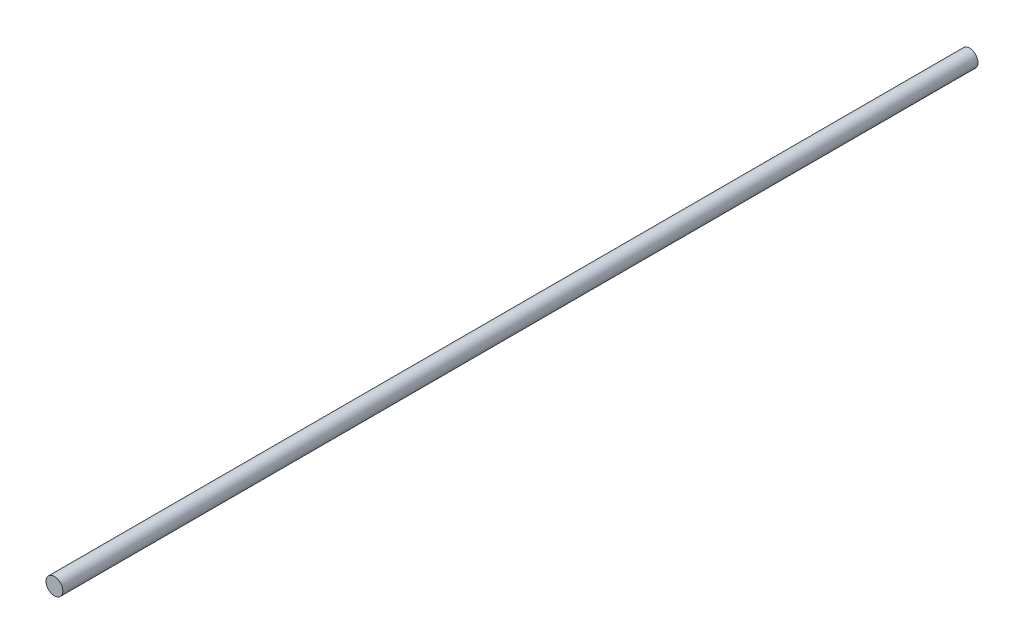
ISO-10303-21;
HEADER;
FILE_DESCRIPTION(('STEP AP214'),'2;1');
FILE_NAME('part.step','',(''),(''),'','','');
FILE_SCHEMA(('AUTOMOTIVE_DESIGN { 1 0 10303 214 1 1 1 1 }'));
ENDSEC;
DATA;
#1=APPLICATION_CONTEXT('core data for automotive mechanical design processes');
#2=APPLICATION_PROTOCOL_DEFINITION('international standard','automotive_design',2000,#1);
#3=PRODUCT_CONTEXT('',#1,'mechanical');
#4=PRODUCT('Part','Part','',(#3));
#5=PRODUCT_RELATED_PRODUCT_CATEGORY('part','',(#4));
#6=PRODUCT_DEFINITION_FORMATION('','',#4);
#7=PRODUCT_DEFINITION_CONTEXT('part definition',#1,'design');
#8=PRODUCT_DEFINITION('design','',#6,#7);
#9=PRODUCT_DEFINITION_SHAPE('','',#8);
#10=(LENGTH_UNIT() NAMED_UNIT(*) SI_UNIT(.MILLI.,.METRE.));
#11=(NAMED_UNIT(*) PLANE_ANGLE_UNIT() SI_UNIT($,.RADIAN.));
#12=(NAMED_UNIT(*) SI_UNIT($,.STERADIAN.) SOLID_ANGLE_UNIT());
#13=UNCERTAINTY_MEASURE_WITH_UNIT(LENGTH_MEASURE(1.E-05),#10,'distance_accuracy_value','');
#14=(GEOMETRIC_REPRESENTATION_CONTEXT(3) GLOBAL_UNCERTAINTY_ASSIGNED_CONTEXT((#13)) GLOBAL_UNIT_ASSIGNED_CONTEXT((#10,
#11,#12)) REPRESENTATION_CONTEXT('',''));
#15=CARTESIAN_POINT('',(0.,0.,0.));
#16=DIRECTION('',(0.,0.,1.));
#17=DIRECTION('',(1.,0.,0.));
#18=AXIS2_PLACEMENT_3D('',#15,#16,#17);
#19=CARTESIAN_POINT('',(0.,0.,435.));
#20=DIRECTION('',(0.,0.,-1.));
#21=DIRECTION('',(-1.,0.,0.));
#22=AXIS2_PLACEMENT_3D('',#19,#20,#21);
#23=CYLINDRICAL_SURFACE('',#22,4.);
#24=CARTESIAN_POINT('',(0.,0.,435.));
#25=DIRECTION('',(0.,0.,1.));
#26=DIRECTION('',(1.,0.,0.));
#27=AXIS2_PLACEMENT_3D('',#24,#25,#26);
#28=CIRCLE('',#27,4.);
#29=CARTESIAN_POINT('',(4.,0.,435.));
#30=VERTEX_POINT('',#29);
#31=EDGE_CURVE('E10',#30,#30,#28,.T.);
#32=ORIENTED_EDGE('',*,*,#31,.F.);
#33=EDGE_LOOP('',(#32));
#34=FACE_BOUND('',#33,.T.);
#35=CARTESIAN_POINT('',(0.,0.,0.));
#36=DIRECTION('',(0.,0.,1.));
#37=DIRECTION('',(1.,0.,0.));
#38=AXIS2_PLACEMENT_3D('',#35,#36,#37);
#39=CIRCLE('',#38,4.);
#40=CARTESIAN_POINT('',(4.,0.,0.));
#41=VERTEX_POINT('',#40);
#42=EDGE_CURVE('E39',#41,#41,#39,.T.);
#43=ORIENTED_EDGE('',*,*,#42,.T.);
#44=EDGE_LOOP('',(#43));
#45=FACE_BOUND('',#44,.T.);
#46=ADVANCED_FACE('F36',(#34,#45),#23,.T.);
#47=CARTESIAN_POINT('',(0.,0.,435.));
#48=DIRECTION('',(0.,0.,1.));
#49=DIRECTION('',(1.,0.,0.));
#50=AXIS2_PLACEMENT_3D('',#47,#48,#49);
#51=PLANE('',#50);
#52=ORIENTED_EDGE('',*,*,#31,.T.);
#53=EDGE_LOOP('',(#52));
#54=FACE_BOUND('',#53,.T.);
#55=ADVANCED_FACE('F52',(#54),#51,.T.);
#56=CARTESIAN_POINT('',(0.,0.,0.));
#57=DIRECTION('',(0.,0.,1.));
#58=DIRECTION('',(1.,0.,0.));
#59=AXIS2_PLACEMENT_3D('',#56,#57,#58);
#60=PLANE('',#59);
#61=ORIENTED_EDGE('',*,*,#42,.F.);
#62=EDGE_LOOP('',(#61));
#63=FACE_BOUND('',#62,.T.);
#64=ADVANCED_FACE('F50',(#63),#60,.F.);
#65=CLOSED_SHELL('',(#46,#55,#64));
#66=MANIFOLD_SOLID_BREP('B2',#65);
#67=ADVANCED_BREP_SHAPE_REPRESENTATION('',(#18,#66),#14);
#68=SHAPE_DEFINITION_REPRESENTATION(#9,#67);
ENDSEC;
END-ISO-10303-21;
